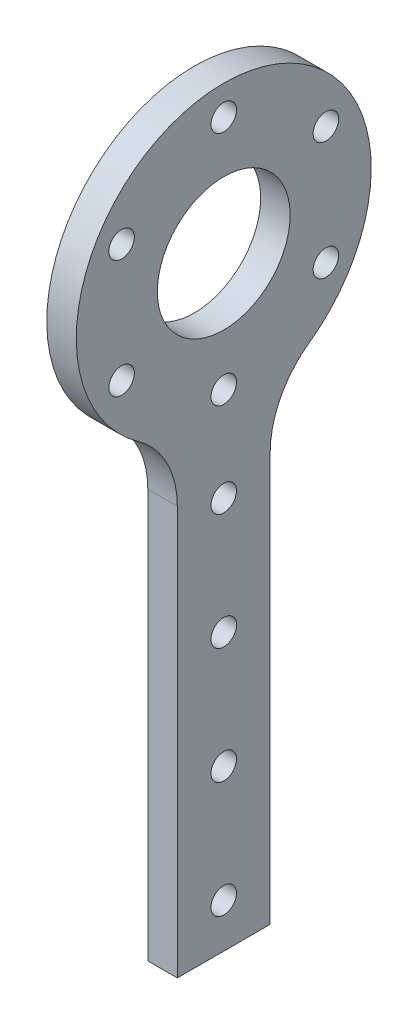
ISO-10303-21;
HEADER;
FILE_DESCRIPTION(('STEP AP214'),'2;1');
FILE_NAME('part.step','',(''),(''),'','','');
FILE_SCHEMA(('AUTOMOTIVE_DESIGN { 1 0 10303 214 1 1 1 1 }'));
ENDSEC;
DATA;
#1=APPLICATION_CONTEXT('core data for automotive mechanical design processes');
#2=APPLICATION_PROTOCOL_DEFINITION('international standard','automotive_design',2000,#1);
#3=PRODUCT_CONTEXT('',#1,'mechanical');
#4=PRODUCT('Part','Part','',(#3));
#5=PRODUCT_RELATED_PRODUCT_CATEGORY('part','',(#4));
#6=PRODUCT_DEFINITION_FORMATION('','',#4);
#7=PRODUCT_DEFINITION_CONTEXT('part definition',#1,'design');
#8=PRODUCT_DEFINITION('design','',#6,#7);
#9=PRODUCT_DEFINITION_SHAPE('','',#8);
#10=(LENGTH_UNIT() NAMED_UNIT(*) SI_UNIT(.MILLI.,.METRE.));
#11=(NAMED_UNIT(*) PLANE_ANGLE_UNIT() SI_UNIT($,.RADIAN.));
#12=(NAMED_UNIT(*) SI_UNIT($,.STERADIAN.) SOLID_ANGLE_UNIT());
#13=UNCERTAINTY_MEASURE_WITH_UNIT(LENGTH_MEASURE(1.E-05),#10,'distance_accuracy_value','');
#14=(GEOMETRIC_REPRESENTATION_CONTEXT(3) GLOBAL_UNCERTAINTY_ASSIGNED_CONTEXT((#13)) GLOBAL_UNIT_ASSIGNED_CONTEXT((#10,
#11,#12)) REPRESENTATION_CONTEXT('',''));
#15=CARTESIAN_POINT('',(0.,0.,0.));
#16=DIRECTION('',(0.,0.,1.));
#17=DIRECTION('',(1.,0.,0.));
#18=AXIS2_PLACEMENT_3D('',#15,#16,#17);
#19=CARTESIAN_POINT('',(6.35,0.,0.));
#20=DIRECTION('',(-1.,0.,0.));
#21=DIRECTION('',(0.,0.,1.));
#22=AXIS2_PLACEMENT_3D('',#19,#20,#21);
#23=CYLINDRICAL_SURFACE('',#22,31.75);
#24=CARTESIAN_POINT('',(6.35,0.,0.));
#25=DIRECTION('',(1.,0.,0.));
#26=DIRECTION('',(0.,0.,-1.));
#27=AXIS2_PLACEMENT_3D('',#24,#25,#26);
#28=CIRCLE('',#27,31.75);
#29=CARTESIAN_POINT('',(6.35,-25.8706229739502,-18.4057971014493));
#30=VERTEX_POINT('',#29);
#31=CARTESIAN_POINT('',(6.35,-25.8706229739502,18.4057971014493));
#32=VERTEX_POINT('',#31);
#33=EDGE_CURVE('E98',#30,#32,#28,.T.);
#34=ORIENTED_EDGE('',*,*,#33,.F.);
#35=DIRECTION('',(-1.,0.,0.));
#36=VECTOR('',#35,1.);
#37=CARTESIAN_POINT('',(6.35,-25.8706229739502,-18.4057971014493));
#38=LINE('',#37,#36);
#39=CARTESIAN_POINT('',(0.,-25.8706229739502,-18.4057971014493));
#40=VERTEX_POINT('',#39);
#41=EDGE_CURVE('E130',#30,#40,#38,.T.);
#42=ORIENTED_EDGE('',*,*,#41,.T.);
#43=CARTESIAN_POINT('',(0.,0.,0.));
#44=DIRECTION('',(1.,0.,0.));
#45=DIRECTION('',(0.,0.,-1.));
#46=AXIS2_PLACEMENT_3D('',#43,#44,#45);
#47=CIRCLE('',#46,31.75);
#48=CARTESIAN_POINT('',(0.,-25.8706229739502,18.4057971014493));
#49=VERTEX_POINT('',#48);
#50=EDGE_CURVE('E118',#40,#49,#47,.T.);
#51=ORIENTED_EDGE('',*,*,#50,.T.);
#52=DIRECTION('',(-1.,0.,0.));
#53=VECTOR('',#52,1.);
#54=CARTESIAN_POINT('',(6.35,-25.8706229739502,18.4057971014493));
#55=LINE('',#54,#53);
#56=EDGE_CURVE('E107',#49,#32,#55,.F.);
#57=ORIENTED_EDGE('',*,*,#56,.T.);
#58=EDGE_LOOP('',(#34,#42,#51,#57));
#59=FACE_BOUND('',#58,.T.);
#60=ADVANCED_FACE('F41',(#59),#23,.T.);
#61=CARTESIAN_POINT('',(6.35,0.,10.));
#62=DIRECTION('',(0.,0.,-1.));
#63=DIRECTION('',(0.,1.,0.));
#64=AXIS2_PLACEMENT_3D('',#61,#62,#63);
#65=PLANE('',#64);
#66=DIRECTION('',(0.,-1.,0.));
#67=VECTOR('',#66,1.);
#68=CARTESIAN_POINT('',(6.35,0.,10.));
#69=LINE('',#68,#67);
#70=CARTESIAN_POINT('',(6.35,-42.1670783906118,10.));
#71=VERTEX_POINT('',#70);
#72=CARTESIAN_POINT('',(6.35,-130.134075396468,9.99999999999999));
#73=VERTEX_POINT('',#72);
#74=EDGE_CURVE('E90',#71,#73,#69,.T.);
#75=ORIENTED_EDGE('',*,*,#74,.F.);
#76=DIRECTION('',(1.,0.,0.));
#77=VECTOR('',#76,1.);
#78=CARTESIAN_POINT('',(0.,-42.1670783906118,10.));
#79=LINE('',#78,#77);
#80=CARTESIAN_POINT('',(0.,-42.1670783906118,10.));
#81=VERTEX_POINT('',#80);
#82=EDGE_CURVE('E135',#71,#81,#79,.F.);
#83=ORIENTED_EDGE('',*,*,#82,.T.);
#84=DIRECTION('',(0.,-1.,0.));
#85=VECTOR('',#84,1.);
#86=CARTESIAN_POINT('',(0.,0.,10.));
#87=LINE('',#86,#85);
#88=CARTESIAN_POINT('',(0.,-130.134075396468,9.99999999999999));
#89=VERTEX_POINT('',#88);
#90=EDGE_CURVE('E104',#81,#89,#87,.T.);
#91=ORIENTED_EDGE('',*,*,#90,.T.);
#92=DIRECTION('',(-1.,0.,0.));
#93=VECTOR('',#92,1.);
#94=CARTESIAN_POINT('',(6.35,-130.134075396468,9.99999999999999));
#95=LINE('',#94,#93);
#96=EDGE_CURVE('E101',#73,#89,#95,.T.);
#97=ORIENTED_EDGE('',*,*,#96,.F.);
#98=EDGE_LOOP('',(#75,#83,#91,#97));
#99=FACE_BOUND('',#98,.T.);
#100=ADVANCED_FACE('F102',(#99),#65,.F.);
#101=CARTESIAN_POINT('',(6.35,-130.134075396468,0.));
#102=DIRECTION('',(0.,1.,0.));
#103=DIRECTION('',(0.,0.,1.));
#104=AXIS2_PLACEMENT_3D('',#101,#102,#103);
#105=PLANE('',#104);
#106=DIRECTION('',(0.,0.,-1.));
#107=VECTOR('',#106,1.);
#108=CARTESIAN_POINT('',(0.,-130.134075396468,0.));
#109=LINE('',#108,#107);
#110=CARTESIAN_POINT('',(0.,-130.134075396468,-9.99999999999999));
#111=VERTEX_POINT('',#110);
#112=EDGE_CURVE('E123',#89,#111,#109,.T.);
#113=ORIENTED_EDGE('',*,*,#112,.T.);
#114=DIRECTION('',(-1.,0.,0.));
#115=VECTOR('',#114,1.);
#116=CARTESIAN_POINT('',(6.35,-130.134075396468,-9.99999999999999));
#117=LINE('',#116,#115);
#118=CARTESIAN_POINT('',(6.35,-130.134075396468,-9.99999999999999));
#119=VERTEX_POINT('',#118);
#120=EDGE_CURVE('E108',#119,#111,#117,.T.);
#121=ORIENTED_EDGE('',*,*,#120,.F.);
#122=DIRECTION('',(0.,0.,-1.));
#123=VECTOR('',#122,1.);
#124=CARTESIAN_POINT('',(6.35,-130.134075396468,0.));
#125=LINE('',#124,#123);
#126=EDGE_CURVE('E95',#73,#119,#125,.T.);
#127=ORIENTED_EDGE('',*,*,#126,.F.);
#128=ORIENTED_EDGE('',*,*,#96,.T.);
#129=EDGE_LOOP('',(#113,#121,#127,#128));
#130=FACE_BOUND('',#129,.T.);
#131=ADVANCED_FACE('F110',(#130),#105,.F.);
#132=CARTESIAN_POINT('',(6.35,0.,-10.));
#133=DIRECTION('',(0.,0.,1.));
#134=DIRECTION('',(0.,-1.,0.));
#135=AXIS2_PLACEMENT_3D('',#132,#133,#134);
#136=PLANE('',#135);
#137=DIRECTION('',(0.,1.,0.));
#138=VECTOR('',#137,1.);
#139=CARTESIAN_POINT('',(0.,0.,-10.));
#140=LINE('',#139,#138);
#141=CARTESIAN_POINT('',(0.,-42.1670783906118,-10.));
#142=VERTEX_POINT('',#141);
#143=EDGE_CURVE('E125',#111,#142,#140,.T.);
#144=ORIENTED_EDGE('',*,*,#143,.T.);
#145=DIRECTION('',(1.,0.,0.));
#146=VECTOR('',#145,1.);
#147=CARTESIAN_POINT('',(6.35,-42.1670783906118,-10.));
#148=LINE('',#147,#146);
#149=CARTESIAN_POINT('',(6.35,-42.1670783906118,-10.));
#150=VERTEX_POINT('',#149);
#151=EDGE_CURVE('E133',#142,#150,#148,.T.);
#152=ORIENTED_EDGE('',*,*,#151,.T.);
#153=DIRECTION('',(0.,1.,0.));
#154=VECTOR('',#153,1.);
#155=CARTESIAN_POINT('',(6.35,0.,-10.));
#156=LINE('',#155,#154);
#157=EDGE_CURVE('E113',#119,#150,#156,.T.);
#158=ORIENTED_EDGE('',*,*,#157,.F.);
#159=ORIENTED_EDGE('',*,*,#120,.T.);
#160=EDGE_LOOP('',(#144,#152,#158,#159));
#161=FACE_BOUND('',#160,.T.);
#162=ADVANCED_FACE('F166',(#161),#136,.F.);
#163=CARTESIAN_POINT('',(6.35,0.,0.));
#164=DIRECTION('',(1.,0.,0.));
#165=DIRECTION('',(0.,0.,-1.));
#166=AXIS2_PLACEMENT_3D('',#163,#164,#165);
#167=PLANE('',#166);
#168=CARTESIAN_POINT('',(6.35,-120.636624279953,0.));
#169=DIRECTION('',(1.,0.,0.));
#170=DIRECTION('',(0.,0.,-1.));
#171=AXIS2_PLACEMENT_3D('',#168,#169,#170);
#172=CIRCLE('',#171,2.75);
#173=CARTESIAN_POINT('',(6.35,-120.636624279953,-2.75));
#174=VERTEX_POINT('',#173);
#175=EDGE_CURVE('E222',#174,#174,#172,.T.);
#176=ORIENTED_EDGE('',*,*,#175,.F.);
#177=EDGE_LOOP('',(#176));
#178=FACE_BOUND('',#177,.T.);
#179=CARTESIAN_POINT('',(6.35,-95.6366242799533,0.));
#180=DIRECTION('',(1.,0.,0.));
#181=DIRECTION('',(0.,0.,-1.));
#182=AXIS2_PLACEMENT_3D('',#179,#180,#181);
#183=CIRCLE('',#182,2.75);
#184=CARTESIAN_POINT('',(6.35,-95.6366242799533,-2.75));
#185=VERTEX_POINT('',#184);
#186=EDGE_CURVE('E223',#185,#185,#183,.T.);
#187=ORIENTED_EDGE('',*,*,#186,.F.);
#188=EDGE_LOOP('',(#187));
#189=FACE_BOUND('',#188,.T.);
#190=CARTESIAN_POINT('',(6.35,-70.6366242799533,0.));
#191=DIRECTION('',(1.,0.,0.));
#192=DIRECTION('',(0.,0.,-1.));
#193=AXIS2_PLACEMENT_3D('',#190,#191,#192);
#194=CIRCLE('',#193,2.75);
#195=CARTESIAN_POINT('',(6.35,-70.6366242799533,-2.75));
#196=VERTEX_POINT('',#195);
#197=EDGE_CURVE('E233',#196,#196,#194,.T.);
#198=ORIENTED_EDGE('',*,*,#197,.F.);
#199=EDGE_LOOP('',(#198));
#200=FACE_BOUND('',#199,.T.);
#201=CARTESIAN_POINT('',(6.35,-45.6366242799533,0.));
#202=DIRECTION('',(1.,0.,0.));
#203=DIRECTION('',(0.,0.,-1.));
#204=AXIS2_PLACEMENT_3D('',#201,#202,#203);
#205=CIRCLE('',#204,2.75);
#206=CARTESIAN_POINT('',(6.35,-45.6366242799533,-2.75));
#207=VERTEX_POINT('',#206);
#208=EDGE_CURVE('E239',#207,#207,#205,.T.);
#209=ORIENTED_EDGE('',*,*,#208,.F.);
#210=EDGE_LOOP('',(#209));
#211=FACE_BOUND('',#210,.T.);
#212=CARTESIAN_POINT('',(6.35,12.7000000000003,21.9970452561246));
#213=DIRECTION('',(1.,0.,0.));
#214=DIRECTION('',(0.,0.,-1.));
#215=AXIS2_PLACEMENT_3D('',#212,#213,#214);
#216=CIRCLE('',#215,2.75);
#217=CARTESIAN_POINT('',(6.35,12.7000000000003,19.2470452561246));
#218=VERTEX_POINT('',#217);
#219=EDGE_CURVE('E276',#218,#218,#216,.T.);
#220=ORIENTED_EDGE('',*,*,#219,.F.);
#221=EDGE_LOOP('',(#220));
#222=FACE_BOUND('',#221,.T.);
#223=CARTESIAN_POINT('',(6.35,-12.6999999999998,21.9970452561249));
#224=DIRECTION('',(1.,0.,0.));
#225=DIRECTION('',(0.,0.,-1.));
#226=AXIS2_PLACEMENT_3D('',#223,#224,#225);
#227=CIRCLE('',#226,2.75);
#228=CARTESIAN_POINT('',(6.35,-12.6999999999998,19.2470452561249));
#229=VERTEX_POINT('',#228);
#230=EDGE_CURVE('E270',#229,#229,#227,.T.);
#231=ORIENTED_EDGE('',*,*,#230,.F.);
#232=EDGE_LOOP('',(#231));
#233=FACE_BOUND('',#232,.T.);
#234=CARTESIAN_POINT('',(6.35,-25.4,1.77367252013231E-13));
#235=DIRECTION('',(1.,0.,0.));
#236=DIRECTION('',(0.,0.,-1.));
#237=AXIS2_PLACEMENT_3D('',#234,#235,#236);
#238=CIRCLE('',#237,2.75);
#239=CARTESIAN_POINT('',(6.35,-25.4,-2.74999999999982));
#240=VERTEX_POINT('',#239);
#241=EDGE_CURVE('E264',#240,#240,#238,.T.);
#242=ORIENTED_EDGE('',*,*,#241,.F.);
#243=EDGE_LOOP('',(#242));
#244=FACE_BOUND('',#243,.T.);
#245=CARTESIAN_POINT('',(6.35,-12.7000000000001,-21.9970452561247));
#246=DIRECTION('',(1.,0.,0.));
#247=DIRECTION('',(0.,0.,-1.));
#248=AXIS2_PLACEMENT_3D('',#245,#246,#247);
#249=CIRCLE('',#248,2.75);
#250=CARTESIAN_POINT('',(6.35,-12.7000000000001,-24.7470452561247));
#251=VERTEX_POINT('',#250);
#252=EDGE_CURVE('E258',#251,#251,#249,.T.);
#253=ORIENTED_EDGE('',*,*,#252,.F.);
#254=EDGE_LOOP('',(#253));
#255=FACE_BOUND('',#254,.T.);
#256=CARTESIAN_POINT('',(6.35,12.6999999999999,-21.9970452561248));
#257=DIRECTION('',(1.,0.,0.));
#258=DIRECTION('',(0.,0.,-1.));
#259=AXIS2_PLACEMENT_3D('',#256,#257,#258);
#260=CIRCLE('',#259,2.75);
#261=CARTESIAN_POINT('',(6.35,12.6999999999999,-24.7470452561248));
#262=VERTEX_POINT('',#261);
#263=EDGE_CURVE('E252',#262,#262,#260,.T.);
#264=ORIENTED_EDGE('',*,*,#263,.F.);
#265=EDGE_LOOP('',(#264));
#266=FACE_BOUND('',#265,.T.);
#267=CARTESIAN_POINT('',(6.35,25.4,0.));
#268=DIRECTION('',(1.,0.,0.));
#269=DIRECTION('',(0.,0.,-1.));
#270=AXIS2_PLACEMENT_3D('',#267,#268,#269);
#271=CIRCLE('',#270,2.75);
#272=CARTESIAN_POINT('',(6.35,25.4,-2.75));
#273=VERTEX_POINT('',#272);
#274=EDGE_CURVE('E245',#273,#273,#271,.T.);
#275=ORIENTED_EDGE('',*,*,#274,.F.);
#276=EDGE_LOOP('',(#275));
#277=FACE_BOUND('',#276,.T.);
#278=CARTESIAN_POINT('',(6.35,0.,0.));
#279=DIRECTION('',(1.,0.,0.));
#280=DIRECTION('',(0.,0.,-1.));
#281=AXIS2_PLACEMENT_3D('',#278,#279,#280);
#282=CIRCLE('',#281,14.3);
#283=CARTESIAN_POINT('',(6.35,0.,-14.3));
#284=VERTEX_POINT('',#283);
#285=EDGE_CURVE('E248',#284,#284,#282,.T.);
#286=ORIENTED_EDGE('',*,*,#285,.F.);
#287=EDGE_LOOP('',(#286));
#288=FACE_BOUND('',#287,.T.);
#289=ORIENTED_EDGE('',*,*,#157,.T.);
#290=CARTESIAN_POINT('',(6.35,-42.1670783906118,-30.));
#291=DIRECTION('',(1.,0.,0.));
#292=DIRECTION('',(0.,0.,-1.));
#293=AXIS2_PLACEMENT_3D('',#290,#291,#292);
#294=CIRCLE('',#293,20.);
#295=EDGE_CURVE('E139',#150,#30,#294,.F.);
#296=ORIENTED_EDGE('',*,*,#295,.T.);
#297=ORIENTED_EDGE('',*,*,#33,.T.);
#298=CARTESIAN_POINT('',(6.35,-42.1670783906118,30.));
#299=DIRECTION('',(1.,0.,0.));
#300=DIRECTION('',(0.,0.,-1.));
#301=AXIS2_PLACEMENT_3D('',#298,#299,#300);
#302=CIRCLE('',#301,20.);
#303=EDGE_CURVE('E11',#32,#71,#302,.F.);
#304=ORIENTED_EDGE('',*,*,#303,.T.);
#305=ORIENTED_EDGE('',*,*,#74,.T.);
#306=ORIENTED_EDGE('',*,*,#126,.T.);
#307=EDGE_LOOP('',(#289,#296,#297,#304,#305,#306));
#308=FACE_BOUND('',#307,.T.);
#309=ADVANCED_FACE('F93',(#178,#189,#200,#211,#222,#233,#244,#255,#266,#277,#288,#308),#167,.T.);
#310=CARTESIAN_POINT('',(0.,0.,0.));
#311=DIRECTION('',(1.,0.,0.));
#312=DIRECTION('',(0.,0.,-1.));
#313=AXIS2_PLACEMENT_3D('',#310,#311,#312);
#314=PLANE('',#313);
#315=CARTESIAN_POINT('',(0.,-120.636624279953,0.));
#316=DIRECTION('',(1.,0.,0.));
#317=DIRECTION('',(0.,0.,-1.));
#318=AXIS2_PLACEMENT_3D('',#315,#316,#317);
#319=CIRCLE('',#318,2.75);
#320=CARTESIAN_POINT('',(0.,-120.636624279953,-2.75));
#321=VERTEX_POINT('',#320);
#322=EDGE_CURVE('E219',#321,#321,#319,.T.);
#323=ORIENTED_EDGE('',*,*,#322,.T.);
#324=EDGE_LOOP('',(#323));
#325=FACE_BOUND('',#324,.T.);
#326=CARTESIAN_POINT('',(0.,-95.6366242799533,0.));
#327=DIRECTION('',(1.,0.,0.));
#328=DIRECTION('',(0.,0.,-1.));
#329=AXIS2_PLACEMENT_3D('',#326,#327,#328);
#330=CIRCLE('',#329,2.75);
#331=CARTESIAN_POINT('',(0.,-95.6366242799533,-2.75));
#332=VERTEX_POINT('',#331);
#333=EDGE_CURVE('E228',#332,#332,#330,.T.);
#334=ORIENTED_EDGE('',*,*,#333,.T.);
#335=EDGE_LOOP('',(#334));
#336=FACE_BOUND('',#335,.T.);
#337=CARTESIAN_POINT('',(0.,-70.6366242799533,0.));
#338=DIRECTION('',(1.,0.,0.));
#339=DIRECTION('',(0.,0.,-1.));
#340=AXIS2_PLACEMENT_3D('',#337,#338,#339);
#341=CIRCLE('',#340,2.75);
#342=CARTESIAN_POINT('',(0.,-70.6366242799533,-2.75));
#343=VERTEX_POINT('',#342);
#344=EDGE_CURVE('E236',#343,#343,#341,.T.);
#345=ORIENTED_EDGE('',*,*,#344,.T.);
#346=EDGE_LOOP('',(#345));
#347=FACE_BOUND('',#346,.T.);
#348=CARTESIAN_POINT('',(0.,-45.6366242799533,0.));
#349=DIRECTION('',(1.,0.,0.));
#350=DIRECTION('',(0.,0.,-1.));
#351=AXIS2_PLACEMENT_3D('',#348,#349,#350);
#352=CIRCLE('',#351,2.75);
#353=CARTESIAN_POINT('',(0.,-45.6366242799533,-2.75));
#354=VERTEX_POINT('',#353);
#355=EDGE_CURVE('E242',#354,#354,#352,.T.);
#356=ORIENTED_EDGE('',*,*,#355,.T.);
#357=EDGE_LOOP('',(#356));
#358=FACE_BOUND('',#357,.T.);
#359=CARTESIAN_POINT('',(0.,12.7000000000003,21.9970452561246));
#360=DIRECTION('',(1.,0.,0.));
#361=DIRECTION('',(0.,0.,-1.));
#362=AXIS2_PLACEMENT_3D('',#359,#360,#361);
#363=CIRCLE('',#362,2.75);
#364=CARTESIAN_POINT('',(0.,12.7000000000003,19.2470452561246));
#365=VERTEX_POINT('',#364);
#366=EDGE_CURVE('E225',#365,#365,#363,.T.);
#367=ORIENTED_EDGE('',*,*,#366,.T.);
#368=EDGE_LOOP('',(#367));
#369=FACE_BOUND('',#368,.T.);
#370=CARTESIAN_POINT('',(0.,-12.6999999999998,21.9970452561249));
#371=DIRECTION('',(1.,0.,0.));
#372=DIRECTION('',(0.,0.,-1.));
#373=AXIS2_PLACEMENT_3D('',#370,#371,#372);
#374=CIRCLE('',#373,2.75);
#375=CARTESIAN_POINT('',(0.,-12.6999999999998,19.2470452561249));
#376=VERTEX_POINT('',#375);
#377=EDGE_CURVE('E273',#376,#376,#374,.T.);
#378=ORIENTED_EDGE('',*,*,#377,.T.);
#379=EDGE_LOOP('',(#378));
#380=FACE_BOUND('',#379,.T.);
#381=CARTESIAN_POINT('',(0.,-25.4,1.77367252013231E-13));
#382=DIRECTION('',(1.,0.,0.));
#383=DIRECTION('',(0.,0.,-1.));
#384=AXIS2_PLACEMENT_3D('',#381,#382,#383);
#385=CIRCLE('',#384,2.75);
#386=CARTESIAN_POINT('',(0.,-25.4,-2.74999999999982));
#387=VERTEX_POINT('',#386);
#388=EDGE_CURVE('E267',#387,#387,#385,.T.);
#389=ORIENTED_EDGE('',*,*,#388,.T.);
#390=EDGE_LOOP('',(#389));
#391=FACE_BOUND('',#390,.T.);
#392=CARTESIAN_POINT('',(0.,-12.7000000000001,-21.9970452561247));
#393=DIRECTION('',(1.,0.,0.));
#394=DIRECTION('',(0.,0.,-1.));
#395=AXIS2_PLACEMENT_3D('',#392,#393,#394);
#396=CIRCLE('',#395,2.75);
#397=CARTESIAN_POINT('',(0.,-12.7000000000001,-24.7470452561247));
#398=VERTEX_POINT('',#397);
#399=EDGE_CURVE('E261',#398,#398,#396,.T.);
#400=ORIENTED_EDGE('',*,*,#399,.T.);
#401=EDGE_LOOP('',(#400));
#402=FACE_BOUND('',#401,.T.);
#403=CARTESIAN_POINT('',(0.,12.6999999999999,-21.9970452561248));
#404=DIRECTION('',(1.,0.,0.));
#405=DIRECTION('',(0.,0.,-1.));
#406=AXIS2_PLACEMENT_3D('',#403,#404,#405);
#407=CIRCLE('',#406,2.75);
#408=CARTESIAN_POINT('',(0.,12.6999999999999,-24.7470452561248));
#409=VERTEX_POINT('',#408);
#410=EDGE_CURVE('E255',#409,#409,#407,.T.);
#411=ORIENTED_EDGE('',*,*,#410,.T.);
#412=EDGE_LOOP('',(#411));
#413=FACE_BOUND('',#412,.T.);
#414=CARTESIAN_POINT('',(0.,25.4,0.));
#415=DIRECTION('',(1.,0.,0.));
#416=DIRECTION('',(0.,0.,-1.));
#417=AXIS2_PLACEMENT_3D('',#414,#415,#416);
#418=CIRCLE('',#417,2.75);
#419=CARTESIAN_POINT('',(0.,25.4,-2.75));
#420=VERTEX_POINT('',#419);
#421=EDGE_CURVE('E249',#420,#420,#418,.T.);
#422=ORIENTED_EDGE('',*,*,#421,.T.);
#423=EDGE_LOOP('',(#422));
#424=FACE_BOUND('',#423,.T.);
#425=CARTESIAN_POINT('',(0.,0.,0.));
#426=DIRECTION('',(1.,0.,0.));
#427=DIRECTION('',(0.,0.,-1.));
#428=AXIS2_PLACEMENT_3D('',#425,#426,#427);
#429=CIRCLE('',#428,14.3);
#430=CARTESIAN_POINT('',(0.,0.,-14.3));
#431=VERTEX_POINT('',#430);
#432=EDGE_CURVE('E121',#431,#431,#429,.T.);
#433=ORIENTED_EDGE('',*,*,#432,.T.);
#434=EDGE_LOOP('',(#433));
#435=FACE_BOUND('',#434,.T.);
#436=ORIENTED_EDGE('',*,*,#50,.F.);
#437=CARTESIAN_POINT('',(0.,-42.1670783906118,-30.));
#438=DIRECTION('',(1.,0.,0.));
#439=DIRECTION('',(0.,0.,-1.));
#440=AXIS2_PLACEMENT_3D('',#437,#438,#439);
#441=CIRCLE('',#440,20.);
#442=EDGE_CURVE('E137',#40,#142,#441,.T.);
#443=ORIENTED_EDGE('',*,*,#442,.T.);
#444=ORIENTED_EDGE('',*,*,#143,.F.);
#445=ORIENTED_EDGE('',*,*,#112,.F.);
#446=ORIENTED_EDGE('',*,*,#90,.F.);
#447=CARTESIAN_POINT('',(0.,-42.1670783906118,30.));
#448=DIRECTION('',(1.,0.,0.));
#449=DIRECTION('',(0.,0.,-1.));
#450=AXIS2_PLACEMENT_3D('',#447,#448,#449);
#451=CIRCLE('',#450,20.);
#452=EDGE_CURVE('E49',#81,#49,#451,.T.);
#453=ORIENTED_EDGE('',*,*,#452,.T.);
#454=EDGE_LOOP('',(#436,#443,#444,#445,#446,#453));
#455=FACE_BOUND('',#454,.T.);
#456=ADVANCED_FACE('F142',(#325,#336,#347,#358,#369,#380,#391,#402,#413,#424,#435,#455),#314,.F.);
#457=CARTESIAN_POINT('',(6.35,-42.1670783906118,-30.));
#458=DIRECTION('',(-1.,0.,0.));
#459=DIRECTION('',(0.,0.,1.));
#460=AXIS2_PLACEMENT_3D('',#457,#458,#459);
#461=CYLINDRICAL_SURFACE('',#460,20.);
#462=ORIENTED_EDGE('',*,*,#295,.F.);
#463=ORIENTED_EDGE('',*,*,#151,.F.);
#464=ORIENTED_EDGE('',*,*,#442,.F.);
#465=ORIENTED_EDGE('',*,*,#41,.F.);
#466=EDGE_LOOP('',(#462,#463,#464,#465));
#467=FACE_BOUND('',#466,.T.);
#468=ADVANCED_FACE('F148',(#467),#461,.F.);
#469=CARTESIAN_POINT('',(6.35,-42.1670783906118,30.));
#470=DIRECTION('',(-1.,0.,0.));
#471=DIRECTION('',(0.,0.,1.));
#472=AXIS2_PLACEMENT_3D('',#469,#470,#471);
#473=CYLINDRICAL_SURFACE('',#472,20.);
#474=ORIENTED_EDGE('',*,*,#303,.F.);
#475=ORIENTED_EDGE('',*,*,#56,.F.);
#476=ORIENTED_EDGE('',*,*,#452,.F.);
#477=ORIENTED_EDGE('',*,*,#82,.F.);
#478=EDGE_LOOP('',(#474,#475,#476,#477));
#479=FACE_BOUND('',#478,.T.);
#480=ADVANCED_FACE('F43',(#479),#473,.F.);
#481=CARTESIAN_POINT('',(0.,0.,0.));
#482=DIRECTION('',(1.,0.,0.));
#483=DIRECTION('',(0.,0.,-1.));
#484=AXIS2_PLACEMENT_3D('',#481,#482,#483);
#485=CYLINDRICAL_SURFACE('',#484,14.3);
#486=ORIENTED_EDGE('',*,*,#432,.F.);
#487=EDGE_LOOP('',(#486));
#488=FACE_BOUND('',#487,.T.);
#489=ORIENTED_EDGE('',*,*,#285,.T.);
#490=EDGE_LOOP('',(#489));
#491=FACE_BOUND('',#490,.T.);
#492=ADVANCED_FACE('F147',(#488,#491),#485,.F.);
#493=CARTESIAN_POINT('',(0.,25.4,0.));
#494=DIRECTION('',(1.,0.,0.));
#495=DIRECTION('',(0.,0.,-1.));
#496=AXIS2_PLACEMENT_3D('',#493,#494,#495);
#497=CYLINDRICAL_SURFACE('',#496,2.75);
#498=ORIENTED_EDGE('',*,*,#421,.F.);
#499=EDGE_LOOP('',(#498));
#500=FACE_BOUND('',#499,.T.);
#501=ORIENTED_EDGE('',*,*,#274,.T.);
#502=EDGE_LOOP('',(#501));
#503=FACE_BOUND('',#502,.T.);
#504=ADVANCED_FACE('F153',(#500,#503),#497,.F.);
#505=CARTESIAN_POINT('',(0.,12.6999999999999,-21.9970452561248));
#506=DIRECTION('',(1.,0.,0.));
#507=DIRECTION('',(0.,0.,-1.));
#508=AXIS2_PLACEMENT_3D('',#505,#506,#507);
#509=CYLINDRICAL_SURFACE('',#508,2.75);
#510=ORIENTED_EDGE('',*,*,#410,.F.);
#511=EDGE_LOOP('',(#510));
#512=FACE_BOUND('',#511,.T.);
#513=ORIENTED_EDGE('',*,*,#263,.T.);
#514=EDGE_LOOP('',(#513));
#515=FACE_BOUND('',#514,.T.);
#516=ADVANCED_FACE('F192',(#512,#515),#509,.F.);
#517=CARTESIAN_POINT('',(0.,-12.7000000000001,-21.9970452561247));
#518=DIRECTION('',(1.,0.,0.));
#519=DIRECTION('',(0.,0.,-1.));
#520=AXIS2_PLACEMENT_3D('',#517,#518,#519);
#521=CYLINDRICAL_SURFACE('',#520,2.75);
#522=ORIENTED_EDGE('',*,*,#399,.F.);
#523=EDGE_LOOP('',(#522));
#524=FACE_BOUND('',#523,.T.);
#525=ORIENTED_EDGE('',*,*,#252,.T.);
#526=EDGE_LOOP('',(#525));
#527=FACE_BOUND('',#526,.T.);
#528=ADVANCED_FACE('F188',(#524,#527),#521,.F.);
#529=CARTESIAN_POINT('',(0.,-25.4,1.77367252013231E-13));
#530=DIRECTION('',(1.,0.,0.));
#531=DIRECTION('',(0.,0.,-1.));
#532=AXIS2_PLACEMENT_3D('',#529,#530,#531);
#533=CYLINDRICAL_SURFACE('',#532,2.75);
#534=ORIENTED_EDGE('',*,*,#388,.F.);
#535=EDGE_LOOP('',(#534));
#536=FACE_BOUND('',#535,.T.);
#537=ORIENTED_EDGE('',*,*,#241,.T.);
#538=EDGE_LOOP('',(#537));
#539=FACE_BOUND('',#538,.T.);
#540=ADVANCED_FACE('F184',(#536,#539),#533,.F.);
#541=CARTESIAN_POINT('',(0.,-12.6999999999998,21.9970452561249));
#542=DIRECTION('',(1.,0.,0.));
#543=DIRECTION('',(0.,0.,-1.));
#544=AXIS2_PLACEMENT_3D('',#541,#542,#543);
#545=CYLINDRICAL_SURFACE('',#544,2.75);
#546=ORIENTED_EDGE('',*,*,#377,.F.);
#547=EDGE_LOOP('',(#546));
#548=FACE_BOUND('',#547,.T.);
#549=ORIENTED_EDGE('',*,*,#230,.T.);
#550=EDGE_LOOP('',(#549));
#551=FACE_BOUND('',#550,.T.);
#552=ADVANCED_FACE('F180',(#548,#551),#545,.F.);
#553=CARTESIAN_POINT('',(0.,12.7000000000003,21.9970452561246));
#554=DIRECTION('',(1.,0.,0.));
#555=DIRECTION('',(0.,0.,-1.));
#556=AXIS2_PLACEMENT_3D('',#553,#554,#555);
#557=CYLINDRICAL_SURFACE('',#556,2.75);
#558=ORIENTED_EDGE('',*,*,#366,.F.);
#559=EDGE_LOOP('',(#558));
#560=FACE_BOUND('',#559,.T.);
#561=ORIENTED_EDGE('',*,*,#219,.T.);
#562=EDGE_LOOP('',(#561));
#563=FACE_BOUND('',#562,.T.);
#564=ADVANCED_FACE('F176',(#560,#563),#557,.F.);
#565=CARTESIAN_POINT('',(0.,-45.6366242799533,0.));
#566=DIRECTION('',(1.,0.,0.));
#567=DIRECTION('',(0.,0.,-1.));
#568=AXIS2_PLACEMENT_3D('',#565,#566,#567);
#569=CYLINDRICAL_SURFACE('',#568,2.75);
#570=ORIENTED_EDGE('',*,*,#355,.F.);
#571=EDGE_LOOP('',(#570));
#572=FACE_BOUND('',#571,.T.);
#573=ORIENTED_EDGE('',*,*,#208,.T.);
#574=EDGE_LOOP('',(#573));
#575=FACE_BOUND('',#574,.T.);
#576=ADVANCED_FACE('F179',(#572,#575),#569,.F.);
#577=CARTESIAN_POINT('',(0.,-70.6366242799533,0.));
#578=DIRECTION('',(1.,0.,0.));
#579=DIRECTION('',(0.,0.,-1.));
#580=AXIS2_PLACEMENT_3D('',#577,#578,#579);
#581=CYLINDRICAL_SURFACE('',#580,2.75);
#582=ORIENTED_EDGE('',*,*,#344,.F.);
#583=EDGE_LOOP('',(#582));
#584=FACE_BOUND('',#583,.T.);
#585=ORIENTED_EDGE('',*,*,#197,.T.);
#586=EDGE_LOOP('',(#585));
#587=FACE_BOUND('',#586,.T.);
#588=ADVANCED_FACE('F202',(#584,#587),#581,.F.);
#589=CARTESIAN_POINT('',(0.,-95.6366242799533,0.));
#590=DIRECTION('',(1.,0.,0.));
#591=DIRECTION('',(0.,0.,-1.));
#592=AXIS2_PLACEMENT_3D('',#589,#590,#591);
#593=CYLINDRICAL_SURFACE('',#592,2.75);
#594=ORIENTED_EDGE('',*,*,#333,.F.);
#595=EDGE_LOOP('',(#594));
#596=FACE_BOUND('',#595,.T.);
#597=ORIENTED_EDGE('',*,*,#186,.T.);
#598=EDGE_LOOP('',(#597));
#599=FACE_BOUND('',#598,.T.);
#600=ADVANCED_FACE('F206',(#596,#599),#593,.F.);
#601=CARTESIAN_POINT('',(0.,-120.636624279953,0.));
#602=DIRECTION('',(1.,0.,0.));
#603=DIRECTION('',(0.,0.,-1.));
#604=AXIS2_PLACEMENT_3D('',#601,#602,#603);
#605=CYLINDRICAL_SURFACE('',#604,2.75);
#606=ORIENTED_EDGE('',*,*,#322,.F.);
#607=EDGE_LOOP('',(#606));
#608=FACE_BOUND('',#607,.T.);
#609=ORIENTED_EDGE('',*,*,#175,.T.);
#610=EDGE_LOOP('',(#609));
#611=FACE_BOUND('',#610,.T.);
#612=ADVANCED_FACE('F210',(#608,#611),#605,.F.);
#613=CLOSED_SHELL('',(#60,#100,#131,#162,#309,#456,#468,#480,#492,#504,#516,#528,#540,#552,#564,
#576,#588,#600,#612));
#614=MANIFOLD_SOLID_BREP('B2',#613);
#615=ADVANCED_BREP_SHAPE_REPRESENTATION('',(#18,#614),#14);
#616=SHAPE_DEFINITION_REPRESENTATION(#9,#615);
ENDSEC;
END-ISO-10303-21;
